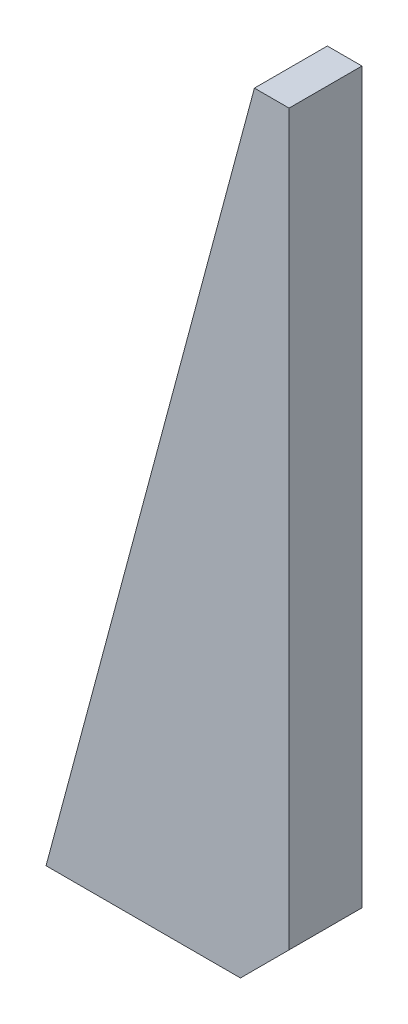
ISO-10303-21;
HEADER;
FILE_DESCRIPTION(('STEP AP214'),'2;1');
FILE_NAME('part.step','',(''),(''),'','','');
FILE_SCHEMA(('AUTOMOTIVE_DESIGN { 1 0 10303 214 1 1 1 1 }'));
ENDSEC;
DATA;
#1=APPLICATION_CONTEXT('core data for automotive mechanical design processes');
#2=APPLICATION_PROTOCOL_DEFINITION('international standard','automotive_design',2000,#1);
#3=PRODUCT_CONTEXT('',#1,'mechanical');
#4=PRODUCT('Part','Part','',(#3));
#5=PRODUCT_RELATED_PRODUCT_CATEGORY('part','',(#4));
#6=PRODUCT_DEFINITION_FORMATION('','',#4);
#7=PRODUCT_DEFINITION_CONTEXT('part definition',#1,'design');
#8=PRODUCT_DEFINITION('design','',#6,#7);
#9=PRODUCT_DEFINITION_SHAPE('','',#8);
#10=(LENGTH_UNIT() NAMED_UNIT(*) SI_UNIT(.MILLI.,.METRE.));
#11=(NAMED_UNIT(*) PLANE_ANGLE_UNIT() SI_UNIT($,.RADIAN.));
#12=(NAMED_UNIT(*) SI_UNIT($,.STERADIAN.) SOLID_ANGLE_UNIT());
#13=UNCERTAINTY_MEASURE_WITH_UNIT(LENGTH_MEASURE(1.E-05),#10,'distance_accuracy_value','');
#14=(GEOMETRIC_REPRESENTATION_CONTEXT(3) GLOBAL_UNCERTAINTY_ASSIGNED_CONTEXT((#13)) GLOBAL_UNIT_ASSIGNED_CONTEXT((#10,
#11,#12)) REPRESENTATION_CONTEXT('',''));
#15=CARTESIAN_POINT('',(0.,0.,0.));
#16=DIRECTION('',(0.,0.,1.));
#17=DIRECTION('',(1.,0.,0.));
#18=AXIS2_PLACEMENT_3D('',#15,#16,#17);
#19=CARTESIAN_POINT('',(7.12812921101967,0.,15.));
#20=DIRECTION('',(0.,-1.,0.));
#21=DIRECTION('',(0.,0.,-1.));
#22=AXIS2_PLACEMENT_3D('',#19,#20,#21);
#23=PLANE('',#22);
#24=DIRECTION('',(-1.,0.,0.));
#25=VECTOR('',#24,1.);
#26=CARTESIAN_POINT('',(7.12812921101967,0.,0.));
#27=LINE('',#26,#25);
#28=CARTESIAN_POINT('',(7.12812921101967,0.,0.));
#29=VERTEX_POINT('',#28);
#30=CARTESIAN_POINT('',(0.,0.,0.));
#31=VERTEX_POINT('',#30);
#32=EDGE_CURVE('E102',#29,#31,#27,.T.);
#33=ORIENTED_EDGE('',*,*,#32,.T.);
#34=DIRECTION('',(0.,0.,-1.));
#35=VECTOR('',#34,1.);
#36=CARTESIAN_POINT('',(0.,0.,15.));
#37=LINE('',#36,#35);
#38=CARTESIAN_POINT('',(0.,0.,15.));
#39=VERTEX_POINT('',#38);
#40=EDGE_CURVE('E84',#39,#31,#37,.T.);
#41=ORIENTED_EDGE('',*,*,#40,.F.);
#42=DIRECTION('',(-1.,0.,0.));
#43=VECTOR('',#42,1.);
#44=CARTESIAN_POINT('',(7.12812921101967,0.,15.));
#45=LINE('',#44,#43);
#46=CARTESIAN_POINT('',(7.12812921101967,0.,15.));
#47=VERTEX_POINT('',#46);
#48=EDGE_CURVE('E90',#47,#39,#45,.T.);
#49=ORIENTED_EDGE('',*,*,#48,.F.);
#50=DIRECTION('',(0.,0.,-1.));
#51=VECTOR('',#50,1.);
#52=CARTESIAN_POINT('',(7.12812921101967,0.,15.));
#53=LINE('',#52,#51);
#54=EDGE_CURVE('E107',#47,#29,#53,.T.);
#55=ORIENTED_EDGE('',*,*,#54,.T.);
#56=EDGE_LOOP('',(#33,#41,#49,#55));
#57=FACE_BOUND('',#56,.T.);
#58=ADVANCED_FACE('F33',(#57),#23,.F.);
#59=CARTESIAN_POINT('',(0.,0.,15.));
#60=DIRECTION('',(0.965925826289067,-0.258819045102525,0.));
#61=DIRECTION('',(0.258819045102525,0.965925826289067,0.));
#62=AXIS2_PLACEMENT_3D('',#59,#60,#61);
#63=PLANE('',#62);
#64=DIRECTION('',(-0.258819045102525,-0.965925826289067,0.));
#65=VECTOR('',#64,1.);
#66=CARTESIAN_POINT('',(0.,0.,0.));
#67=LINE('',#66,#65);
#68=CARTESIAN_POINT('',(-42.8718707889803,-160.,0.));
#69=VERTEX_POINT('',#68);
#70=EDGE_CURVE('E115',#31,#69,#67,.T.);
#71=ORIENTED_EDGE('',*,*,#70,.T.);
#72=DIRECTION('',(0.,0.,-1.));
#73=VECTOR('',#72,1.);
#74=CARTESIAN_POINT('',(-42.8718707889803,-160.,15.));
#75=LINE('',#74,#73);
#76=CARTESIAN_POINT('',(-42.8718707889803,-160.,15.));
#77=VERTEX_POINT('',#76);
#78=EDGE_CURVE('E87',#77,#69,#75,.T.);
#79=ORIENTED_EDGE('',*,*,#78,.F.);
#80=DIRECTION('',(-0.258819045102525,-0.965925826289067,0.));
#81=VECTOR('',#80,1.);
#82=CARTESIAN_POINT('',(0.,0.,15.));
#83=LINE('',#82,#81);
#84=EDGE_CURVE('E80',#39,#77,#83,.T.);
#85=ORIENTED_EDGE('',*,*,#84,.F.);
#86=ORIENTED_EDGE('',*,*,#40,.T.);
#87=EDGE_LOOP('',(#71,#79,#85,#86));
#88=FACE_BOUND('',#87,.T.);
#89=ADVANCED_FACE('F82',(#88),#63,.F.);
#90=CARTESIAN_POINT('',(-42.8718707889803,-160.,15.));
#91=DIRECTION('',(0.,1.,0.));
#92=DIRECTION('',(0.,0.,1.));
#93=AXIS2_PLACEMENT_3D('',#90,#91,#92);
#94=PLANE('',#93);
#95=DIRECTION('',(1.,0.,0.));
#96=VECTOR('',#95,1.);
#97=CARTESIAN_POINT('',(-42.8718707889803,-160.,0.));
#98=LINE('',#97,#96);
#99=CARTESIAN_POINT('',(-2.87187078898037,-160.,0.));
#100=VERTEX_POINT('',#99);
#101=EDGE_CURVE('E113',#69,#100,#98,.T.);
#102=ORIENTED_EDGE('',*,*,#101,.T.);
#103=DIRECTION('',(0.,0.,1.));
#104=VECTOR('',#103,1.);
#105=CARTESIAN_POINT('',(-2.87187078898037,-160.,15.));
#106=LINE('',#105,#104);
#107=CARTESIAN_POINT('',(-2.87187078898037,-160.,15.));
#108=VERTEX_POINT('',#107);
#109=EDGE_CURVE('E41',#100,#108,#106,.T.);
#110=ORIENTED_EDGE('',*,*,#109,.T.);
#111=DIRECTION('',(1.,0.,0.));
#112=VECTOR('',#111,1.);
#113=CARTESIAN_POINT('',(-42.8718707889803,-160.,15.));
#114=LINE('',#113,#112);
#115=EDGE_CURVE('E89',#77,#108,#114,.T.);
#116=ORIENTED_EDGE('',*,*,#115,.F.);
#117=ORIENTED_EDGE('',*,*,#78,.T.);
#118=EDGE_LOOP('',(#102,#110,#116,#117));
#119=FACE_BOUND('',#118,.T.);
#120=ADVANCED_FACE('F125',(#119),#94,.F.);
#121=CARTESIAN_POINT('',(7.12812921101967,-160.,15.));
#122=DIRECTION('',(-1.,0.,0.));
#123=DIRECTION('',(0.,0.,1.));
#124=AXIS2_PLACEMENT_3D('',#121,#122,#123);
#125=PLANE('',#124);
#126=DIRECTION('',(0.,1.,0.));
#127=VECTOR('',#126,1.);
#128=CARTESIAN_POINT('',(7.12812921101967,-160.,15.));
#129=LINE('',#128,#127);
#130=CARTESIAN_POINT('',(7.12812921101967,-150.,15.));
#131=VERTEX_POINT('',#130);
#132=EDGE_CURVE('E95',#131,#47,#129,.T.);
#133=ORIENTED_EDGE('',*,*,#132,.F.);
#134=DIRECTION('',(0.,0.,-1.));
#135=VECTOR('',#134,1.);
#136=CARTESIAN_POINT('',(7.12812921101967,-150.,15.));
#137=LINE('',#136,#135);
#138=CARTESIAN_POINT('',(7.12812921101967,-150.,0.));
#139=VERTEX_POINT('',#138);
#140=EDGE_CURVE('E103',#131,#139,#137,.T.);
#141=ORIENTED_EDGE('',*,*,#140,.T.);
#142=DIRECTION('',(0.,1.,0.));
#143=VECTOR('',#142,1.);
#144=CARTESIAN_POINT('',(7.12812921101967,-160.,0.));
#145=LINE('',#144,#143);
#146=EDGE_CURVE('E99',#139,#29,#145,.T.);
#147=ORIENTED_EDGE('',*,*,#146,.T.);
#148=ORIENTED_EDGE('',*,*,#54,.F.);
#149=EDGE_LOOP('',(#133,#141,#147,#148));
#150=FACE_BOUND('',#149,.T.);
#151=ADVANCED_FACE('F123',(#150),#125,.F.);
#152=CARTESIAN_POINT('',(0.,0.,15.));
#153=DIRECTION('',(0.,0.,-1.));
#154=DIRECTION('',(-1.,0.,0.));
#155=AXIS2_PLACEMENT_3D('',#152,#153,#154);
#156=PLANE('',#155);
#157=ORIENTED_EDGE('',*,*,#115,.T.);
#158=DIRECTION('',(-0.707106781186548,-0.707106781186548,0.));
#159=VECTOR('',#158,1.);
#160=CARTESIAN_POINT('',(7.12812921101967,-150.,15.));
#161=LINE('',#160,#159);
#162=EDGE_CURVE('E11',#108,#131,#161,.F.);
#163=ORIENTED_EDGE('',*,*,#162,.T.);
#164=ORIENTED_EDGE('',*,*,#132,.T.);
#165=ORIENTED_EDGE('',*,*,#48,.T.);
#166=ORIENTED_EDGE('',*,*,#84,.T.);
#167=EDGE_LOOP('',(#157,#163,#164,#165,#166));
#168=FACE_BOUND('',#167,.T.);
#169=ADVANCED_FACE('F93',(#168),#156,.F.);
#170=CARTESIAN_POINT('',(0.,0.,0.));
#171=DIRECTION('',(0.,0.,-1.));
#172=DIRECTION('',(-1.,0.,0.));
#173=AXIS2_PLACEMENT_3D('',#170,#171,#172);
#174=PLANE('',#173);
#175=ORIENTED_EDGE('',*,*,#146,.F.);
#176=DIRECTION('',(0.707106781186548,0.707106781186548,0.));
#177=VECTOR('',#176,1.);
#178=CARTESIAN_POINT('',(78.5640646055098,-78.5640646055098,0.));
#179=LINE('',#178,#177);
#180=EDGE_CURVE('E55',#139,#100,#179,.F.);
#181=ORIENTED_EDGE('',*,*,#180,.T.);
#182=ORIENTED_EDGE('',*,*,#101,.F.);
#183=ORIENTED_EDGE('',*,*,#70,.F.);
#184=ORIENTED_EDGE('',*,*,#32,.F.);
#185=EDGE_LOOP('',(#175,#181,#182,#183,#184));
#186=FACE_BOUND('',#185,.T.);
#187=ADVANCED_FACE('F124',(#186),#174,.T.);
#188=CARTESIAN_POINT('',(7.12812921101967,-150.,15.));
#189=DIRECTION('',(-0.707106781186547,0.707106781186547,0.));
#190=DIRECTION('',(0.,0.,-1.));
#191=AXIS2_PLACEMENT_3D('',#188,#189,#190);
#192=PLANE('',#191);
#193=ORIENTED_EDGE('',*,*,#162,.F.);
#194=ORIENTED_EDGE('',*,*,#109,.F.);
#195=ORIENTED_EDGE('',*,*,#180,.F.);
#196=ORIENTED_EDGE('',*,*,#140,.F.);
#197=EDGE_LOOP('',(#193,#194,#195,#196));
#198=FACE_BOUND('',#197,.T.);
#199=ADVANCED_FACE('F35',(#198),#192,.F.);
#200=CLOSED_SHELL('',(#58,#89,#120,#151,#169,#187,#199));
#201=MANIFOLD_SOLID_BREP('B2',#200);
#202=ADVANCED_BREP_SHAPE_REPRESENTATION('',(#18,#201),#14);
#203=SHAPE_DEFINITION_REPRESENTATION(#9,#202);
ENDSEC;
END-ISO-10303-21;
